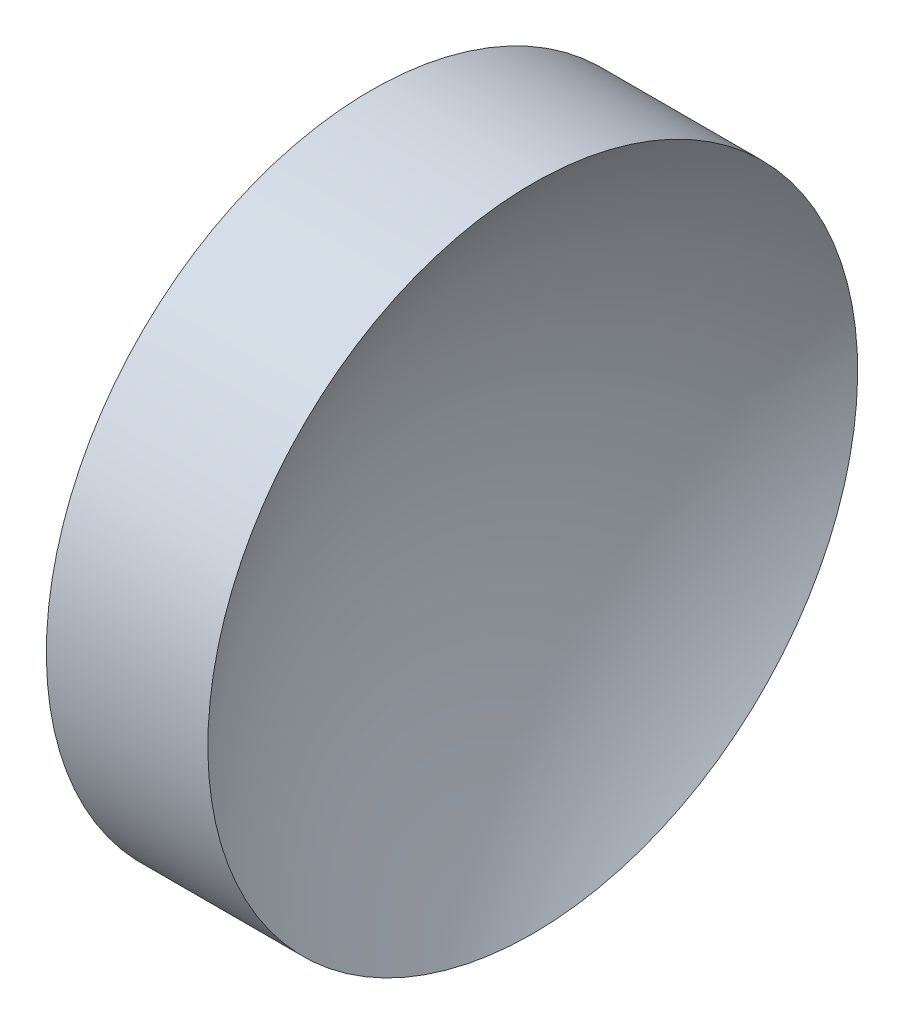
ISO-10303-21;
HEADER;
FILE_DESCRIPTION(('STEP AP214'),'2;1');
FILE_NAME('part.step','',(''),(''),'','','');
FILE_SCHEMA(('AUTOMOTIVE_DESIGN { 1 0 10303 214 1 1 1 1 }'));
ENDSEC;
DATA;
#1=APPLICATION_CONTEXT('core data for automotive mechanical design processes');
#2=APPLICATION_PROTOCOL_DEFINITION('international standard','automotive_design',2000,#1);
#3=PRODUCT_CONTEXT('',#1,'mechanical');
#4=PRODUCT('Part','Part','',(#3));
#5=PRODUCT_RELATED_PRODUCT_CATEGORY('part','',(#4));
#6=PRODUCT_DEFINITION_FORMATION('','',#4);
#7=PRODUCT_DEFINITION_CONTEXT('part definition',#1,'design');
#8=PRODUCT_DEFINITION('design','',#6,#7);
#9=PRODUCT_DEFINITION_SHAPE('','',#8);
#10=(LENGTH_UNIT() NAMED_UNIT(*) SI_UNIT(.MILLI.,.METRE.));
#11=(NAMED_UNIT(*) PLANE_ANGLE_UNIT() SI_UNIT($,.RADIAN.));
#12=(NAMED_UNIT(*) SI_UNIT($,.STERADIAN.) SOLID_ANGLE_UNIT());
#13=UNCERTAINTY_MEASURE_WITH_UNIT(LENGTH_MEASURE(1.E-05),#10,'distance_accuracy_value','');
#14=(GEOMETRIC_REPRESENTATION_CONTEXT(3) GLOBAL_UNCERTAINTY_ASSIGNED_CONTEXT((#13)) GLOBAL_UNIT_ASSIGNED_CONTEXT((#10,
#11,#12)) REPRESENTATION_CONTEXT('',''));
#15=CARTESIAN_POINT('',(0.,0.,0.));
#16=DIRECTION('',(0.,0.,1.));
#17=DIRECTION('',(1.,0.,0.));
#18=AXIS2_PLACEMENT_3D('',#15,#16,#17);
#19=CARTESIAN_POINT('',(80.0081896406123,32.5787747187973,0.));
#20=DIRECTION('',(0.,0.,-1.));
#21=DIRECTION('',(0.,-1.,0.));
#22=AXIS2_PLACEMENT_3D('',#19,#20,#21);
#23=CIRCLE('',#22,20.65);
#24=TRIMMED_CURVE('',#23,(PARAMETER_VALUE(-1.57079396333222)),
(PARAMETER_VALUE(1.57079396333222)),.T.,.PARAMETER.);
#25=CARTESIAN_POINT('',(80.0081896406123,32.5787259132931,0.));
#26=DIRECTION('',(-1.,0.,0.));
#27=AXIS1_PLACEMENT('',#25,#26);
#28=SURFACE_OF_REVOLUTION('',#24,#27);
#29=CARTESIAN_POINT('',(63.5713018615949,32.5787259132931,0.));
#30=DIRECTION('',(-1.,0.,0.));
#31=DIRECTION('',(0.,-1.,0.));
#32=AXIS2_PLACEMENT_3D('',#29,#30,#31);
#33=CIRCLE('',#32,12.5);
#34=CARTESIAN_POINT('',(63.5713018615949,20.0787259132931,0.));
#35=VERTEX_POINT('',#34);
#36=EDGE_CURVE('E11',#35,#35,#33,.T.);
#37=ORIENTED_EDGE('',*,*,#36,.F.);
#38=EDGE_LOOP('',(#37));
#39=FACE_BOUND('',#38,.T.);
#40=CARTESIAN_POINT('',(59.35818964067,32.5787259132931,0.));
#41=VERTEX_POINT('',#40);
#42=VERTEX_LOOP('',#41);
#43=FACE_BOUND('',#42,.T.);
#44=ADVANCED_FACE('F37',(#39,#43),#28,.F.);
#45=CARTESIAN_POINT('',(55.0073946244212,32.5787259132931,0.));
#46=DIRECTION('',(-1.,0.,0.));
#47=DIRECTION('',(0.,-1.,0.));
#48=AXIS2_PLACEMENT_3D('',#45,#46,#47);
#49=CYLINDRICAL_SURFACE('',#48,12.5);
#50=CARTESIAN_POINT('',(57.3581901580211,32.5787259132931,0.));
#51=DIRECTION('',(-1.,0.,0.));
#52=DIRECTION('',(0.,-1.,0.));
#53=AXIS2_PLACEMENT_3D('',#50,#51,#52);
#54=CIRCLE('',#53,12.5);
#55=CARTESIAN_POINT('',(57.3581901580211,20.0787259132931,0.));
#56=VERTEX_POINT('',#55);
#57=EDGE_CURVE('E43',#56,#56,#54,.T.);
#58=ORIENTED_EDGE('',*,*,#57,.F.);
#59=EDGE_LOOP('',(#58));
#60=FACE_BOUND('',#59,.T.);
#61=ORIENTED_EDGE('',*,*,#36,.T.);
#62=EDGE_LOOP('',(#61));
#63=FACE_BOUND('',#62,.T.);
#64=ADVANCED_FACE('F47',(#60,#63),#49,.T.);
#65=CARTESIAN_POINT('',(57.3581901580211,32.5787259132931,0.));
#66=DIRECTION('',(1.,0.,0.));
#67=DIRECTION('',(0.,1.,0.));
#68=AXIS2_PLACEMENT_3D('',#65,#66,#67);
#69=PLANE('',#68);
#70=ORIENTED_EDGE('',*,*,#57,.T.);
#71=EDGE_LOOP('',(#70));
#72=FACE_BOUND('',#71,.T.);
#73=ADVANCED_FACE('F52',(#72),#69,.F.);
#74=CLOSED_SHELL('',(#44,#64,#73));
#75=MANIFOLD_SOLID_BREP('B2',#74);
#76=ADVANCED_BREP_SHAPE_REPRESENTATION('',(#18,#75),#14);
#77=SHAPE_DEFINITION_REPRESENTATION(#9,#76);
ENDSEC;
END-ISO-10303-21;
